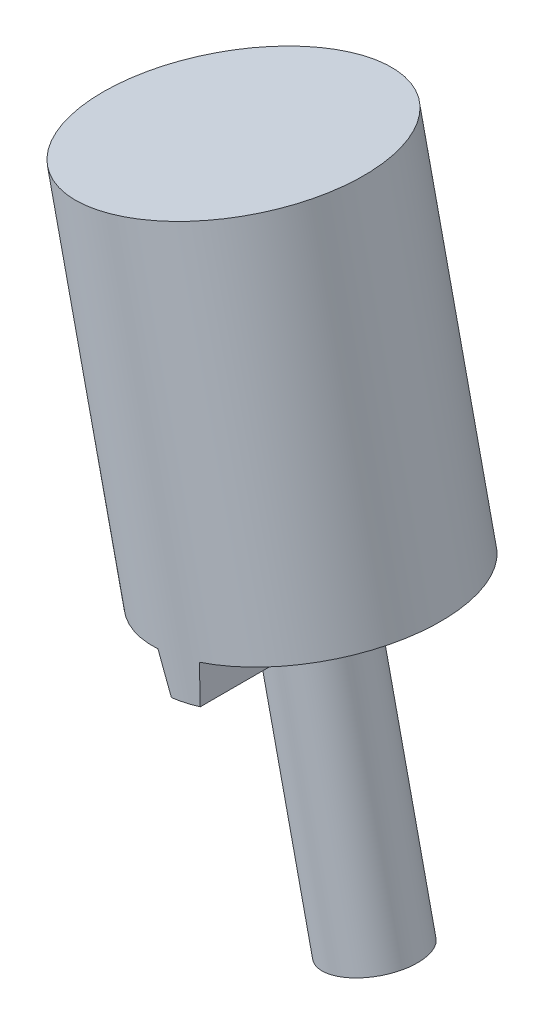
ISO-10303-21;
HEADER;
FILE_DESCRIPTION(('STEP AP214'),'2;1');
FILE_NAME('part.step','',(''),(''),'','','');
FILE_SCHEMA(('AUTOMOTIVE_DESIGN { 1 0 10303 214 1 1 1 1 }'));
ENDSEC;
DATA;
#1=APPLICATION_CONTEXT('core data for automotive mechanical design processes');
#2=APPLICATION_PROTOCOL_DEFINITION('international standard','automotive_design',2000,#1);
#3=PRODUCT_CONTEXT('',#1,'mechanical');
#4=PRODUCT('Part','Part','',(#3));
#5=PRODUCT_RELATED_PRODUCT_CATEGORY('part','',(#4));
#6=PRODUCT_DEFINITION_FORMATION('','',#4);
#7=PRODUCT_DEFINITION_CONTEXT('part definition',#1,'design');
#8=PRODUCT_DEFINITION('design','',#6,#7);
#9=PRODUCT_DEFINITION_SHAPE('','',#8);
#10=(LENGTH_UNIT() NAMED_UNIT(*) SI_UNIT(.MILLI.,.METRE.));
#11=(NAMED_UNIT(*) PLANE_ANGLE_UNIT() SI_UNIT($,.RADIAN.));
#12=(NAMED_UNIT(*) SI_UNIT($,.STERADIAN.) SOLID_ANGLE_UNIT());
#13=UNCERTAINTY_MEASURE_WITH_UNIT(LENGTH_MEASURE(1.E-05),#10,'distance_accuracy_value','');
#14=(GEOMETRIC_REPRESENTATION_CONTEXT(3) GLOBAL_UNCERTAINTY_ASSIGNED_CONTEXT((#13)) GLOBAL_UNIT_ASSIGNED_CONTEXT((#10,
#11,#12)) REPRESENTATION_CONTEXT('',''));
#15=CARTESIAN_POINT('',(0.,0.,0.));
#16=DIRECTION('',(0.,0.,1.));
#17=DIRECTION('',(1.,0.,0.));
#18=AXIS2_PLACEMENT_3D('',#15,#16,#17);
#19=CARTESIAN_POINT('',(-0.694547757658262,0.496439960766251,2.2987));
#20=DIRECTION('',(0.216439613938103,-0.976296007119933,0.));
#21=DIRECTION('',(0.976296007119933,0.216439613938103,0.));
#22=AXIS2_PLACEMENT_3D('',#19,#20,#21);
#23=PLANE('',#22);
#24=DIRECTION('',(0.,0.,1.));
#25=VECTOR('',#24,1.);
#26=CARTESIAN_POINT('',(-1.19050612927519,0.386488636885694,2.2987));
#27=LINE('',#26,#25);
#28=CARTESIAN_POINT('',(-1.19050612927519,0.386488636885694,-2.28462375239338));
#29=VERTEX_POINT('',#28);
#30=CARTESIAN_POINT('',(-1.19050612927519,0.386488636885694,-0.718420489685532));
#31=VERTEX_POINT('',#30);
#32=EDGE_CURVE('E117',#29,#31,#27,.T.);
#33=ORIENTED_EDGE('',*,*,#32,.F.);
#34=CARTESIAN_POINT('',(-0.942526943466727,0.441464298825973,0.));
#35=DIRECTION('',(-0.216439613938103,0.976296007119933,0.));
#36=DIRECTION('',(-0.976296007119933,-0.216439613938103,0.));
#37=AXIS2_PLACEMENT_3D('',#34,#35,#36);
#38=CIRCLE('',#37,2.2987);
#39=CARTESIAN_POINT('',(-0.694547757658263,0.496439960766251,-2.28462375239338));
#40=VERTEX_POINT('',#39);
#41=EDGE_CURVE('E92',#29,#40,#38,.F.);
#42=ORIENTED_EDGE('',*,*,#41,.T.);
#43=DIRECTION('',(0.,0.,1.));
#44=VECTOR('',#43,1.);
#45=CARTESIAN_POINT('',(-0.694547757658263,0.496439960766251,2.2987));
#46=LINE('',#45,#44);
#47=CARTESIAN_POINT('',(-0.694547757658263,0.496439960766251,-0.718420489685532));
#48=VERTEX_POINT('',#47);
#49=EDGE_CURVE('E94',#48,#40,#46,.F.);
#50=ORIENTED_EDGE('',*,*,#49,.F.);
#51=CARTESIAN_POINT('',(-0.942526943466726,0.441464298825972,0.));
#52=DIRECTION('',(-0.216439613938103,0.976296007119933,0.));
#53=DIRECTION('',(-0.976296007119933,-0.216439613938103,0.));
#54=AXIS2_PLACEMENT_3D('',#51,#52,#53);
#55=CIRCLE('',#54,0.762);
#56=EDGE_CURVE('E20',#48,#31,#55,.T.);
#57=ORIENTED_EDGE('',*,*,#56,.T.);
#58=EDGE_LOOP('',(#33,#42,#50,#57));
#59=FACE_BOUND('',#58,.T.);
#60=ADVANCED_FACE('F17',(#59),#23,.T.);
#61=CARTESIAN_POINT('',(0.763484697913529,-3.73324446700129,0.));
#62=DIRECTION('',(-0.216439613938103,0.976296007119933,0.));
#63=DIRECTION('',(-0.976296007119933,-0.216439613938103,0.));
#64=AXIS2_PLACEMENT_3D('',#61,#62,#63);
#65=PLANE('',#64);
#66=CARTESIAN_POINT('',(0.0195471404881398,-3.89817145282212,0.));
#67=DIRECTION('',(-0.216439613938103,0.976296007119933,0.));
#68=DIRECTION('',(-0.976296007119933,-0.216439613938103,0.));
#69=AXIS2_PLACEMENT_3D('',#66,#67,#68);
#70=CIRCLE('',#69,0.762);
#71=CARTESIAN_POINT('',(-0.724390416937249,-4.06309843864296,0.));
#72=VERTEX_POINT('',#71);
#73=EDGE_CURVE('E105',#72,#72,#70,.T.);
#74=ORIENTED_EDGE('',*,*,#73,.F.);
#75=EDGE_LOOP('',(#74));
#76=FACE_BOUND('',#75,.T.);
#77=ADVANCED_FACE('F179',(#76),#65,.F.);
#78=CARTESIAN_POINT('',(-0.694547757658262,0.496439960766251,2.2987));
#79=DIRECTION('',(0.216439613938103,-0.976296007119933,0.));
#80=DIRECTION('',(0.976296007119933,0.216439613938103,0.));
#81=AXIS2_PLACEMENT_3D('',#78,#79,#80);
#82=PLANE('',#81);
#83=DIRECTION('',(0.,0.,1.));
#84=VECTOR('',#83,1.);
#85=CARTESIAN_POINT('',(-0.694547757658263,0.496439960766251,2.2987));
#86=LINE('',#85,#84);
#87=CARTESIAN_POINT('',(-0.694547757658263,0.496439960766251,2.28462375239338));
#88=VERTEX_POINT('',#87);
#89=CARTESIAN_POINT('',(-0.694547757658263,0.496439960766251,0.718420489685532));
#90=VERTEX_POINT('',#89);
#91=EDGE_CURVE('E121',#88,#90,#86,.F.);
#92=ORIENTED_EDGE('',*,*,#91,.F.);
#93=CARTESIAN_POINT('',(-0.942526943466726,0.441464298825972,0.));
#94=DIRECTION('',(-0.216439613938103,0.976296007119933,0.));
#95=DIRECTION('',(-0.976296007119933,-0.216439613938103,0.));
#96=AXIS2_PLACEMENT_3D('',#93,#94,#95);
#97=CIRCLE('',#96,2.2987);
#98=CARTESIAN_POINT('',(-1.19050612927519,0.386488636885694,2.28462375239338));
#99=VERTEX_POINT('',#98);
#100=EDGE_CURVE('E122',#88,#99,#97,.F.);
#101=ORIENTED_EDGE('',*,*,#100,.T.);
#102=DIRECTION('',(0.,0.,1.));
#103=VECTOR('',#102,1.);
#104=CARTESIAN_POINT('',(-1.19050612927519,0.386488636885694,2.2987));
#105=LINE('',#104,#103);
#106=CARTESIAN_POINT('',(-1.19050612927519,0.386488636885694,0.718420489685532));
#107=VERTEX_POINT('',#106);
#108=EDGE_CURVE('E145',#107,#99,#105,.T.);
#109=ORIENTED_EDGE('',*,*,#108,.F.);
#110=CARTESIAN_POINT('',(-0.942526943466727,0.441464298825973,0.));
#111=DIRECTION('',(-0.216439613938103,0.976296007119933,0.));
#112=DIRECTION('',(-0.976296007119933,-0.216439613938103,0.));
#113=AXIS2_PLACEMENT_3D('',#110,#111,#112);
#114=CIRCLE('',#113,0.762);
#115=EDGE_CURVE('E108',#90,#107,#114,.F.);
#116=ORIENTED_EDGE('',*,*,#115,.F.);
#117=EDGE_LOOP('',(#92,#101,#109,#116));
#118=FACE_BOUND('',#117,.T.);
#119=ADVANCED_FACE('F149',(#118),#82,.T.);
#120=CARTESIAN_POINT('',(-0.722673359728584,1.14062215649335,2.2987));
#121=DIRECTION('',(0.999048221581858,0.043619387365336,0.));
#122=DIRECTION('',(-0.043619387365336,0.999048221581858,0.));
#123=AXIS2_PLACEMENT_3D('',#120,#121,#122);
#124=PLANE('',#123);
#125=DIRECTION('',(0.,0.,1.));
#126=VECTOR('',#125,1.);
#127=CARTESIAN_POINT('',(-0.722673359728584,1.14062215649335,2.2987));
#128=LINE('',#127,#126);
#129=CARTESIAN_POINT('',(-0.722673359728584,1.14062215649335,2.26938083665555));
#130=VERTEX_POINT('',#129);
#131=CARTESIAN_POINT('',(-0.722673359728584,1.14062215649335,0.668364939071052));
#132=VERTEX_POINT('',#131);
#133=EDGE_CURVE('E143',#130,#132,#128,.F.);
#134=ORIENTED_EDGE('',*,*,#133,.F.);
#135=CARTESIAN_POINT('',(-0.630744471383377,-0.964895549293167,0.));
#136=DIRECTION('',(0.999048221581858,0.043619387365336,0.));
#137=DIRECTION('',(-0.043619387365336,0.999048221581858,0.));
#138=AXIS2_PLACEMENT_3D('',#135,#136,#137);
#139=ELLIPSE('',#138,13.2376857096023,2.2987);
#140=EDGE_CURVE('E98',#130,#88,#139,.T.);
#141=ORIENTED_EDGE('',*,*,#140,.T.);
#142=ORIENTED_EDGE('',*,*,#91,.T.);
#143=CARTESIAN_POINT('',(-0.630744471383377,-0.964895549293168,0.));
#144=DIRECTION('',(0.999048221581858,0.043619387365336,0.));
#145=DIRECTION('',(-0.043619387365336,0.999048221581858,0.));
#146=AXIS2_PLACEMENT_3D('',#143,#144,#145);
#147=ELLIPSE('',#146,4.38818310815544,0.762);
#148=EDGE_CURVE('E104',#132,#90,#147,.T.);
#149=ORIENTED_EDGE('',*,*,#148,.F.);
#150=EDGE_LOOP('',(#134,#141,#142,#149));
#151=FACE_BOUND('',#150,.T.);
#152=ADVANCED_FACE('F170',(#151),#124,.T.);
#153=CARTESIAN_POINT('',(-0.722673359728584,1.14062215649335,2.2987));
#154=DIRECTION('',(0.999048221581858,0.043619387365336,0.));
#155=DIRECTION('',(-0.043619387365336,0.999048221581858,0.));
#156=AXIS2_PLACEMENT_3D('',#153,#154,#155);
#157=PLANE('',#156);
#158=ORIENTED_EDGE('',*,*,#49,.T.);
#159=CARTESIAN_POINT('',(-0.630744471383377,-0.964895549293167,0.));
#160=DIRECTION('',(0.999048221581858,0.043619387365336,0.));
#161=DIRECTION('',(-0.043619387365336,0.999048221581858,0.));
#162=AXIS2_PLACEMENT_3D('',#159,#160,#161);
#163=ELLIPSE('',#162,13.2376857096023,2.2987);
#164=CARTESIAN_POINT('',(-0.722673359728584,1.14062215649335,-2.26938083665555));
#165=VERTEX_POINT('',#164);
#166=EDGE_CURVE('E97',#40,#165,#163,.T.);
#167=ORIENTED_EDGE('',*,*,#166,.T.);
#168=DIRECTION('',(0.,0.,1.));
#169=VECTOR('',#168,1.);
#170=CARTESIAN_POINT('',(-0.722673359728584,1.14062215649335,2.2987));
#171=LINE('',#170,#169);
#172=CARTESIAN_POINT('',(-0.722673359728584,1.14062215649335,-0.668364939071053));
#173=VERTEX_POINT('',#172);
#174=EDGE_CURVE('E102',#173,#165,#171,.F.);
#175=ORIENTED_EDGE('',*,*,#174,.F.);
#176=CARTESIAN_POINT('',(-0.630744471383377,-0.964895549293168,0.));
#177=DIRECTION('',(0.999048221581858,0.043619387365336,0.));
#178=DIRECTION('',(-0.043619387365336,0.999048221581858,0.));
#179=AXIS2_PLACEMENT_3D('',#176,#177,#178);
#180=ELLIPSE('',#179,4.38818310815544,0.762);
#181=EDGE_CURVE('E85',#48,#173,#180,.T.);
#182=ORIENTED_EDGE('',*,*,#181,.F.);
#183=EDGE_LOOP('',(#158,#167,#175,#182));
#184=FACE_BOUND('',#183,.T.);
#185=ADVANCED_FACE('F100',(#184),#157,.T.);
#186=CARTESIAN_POINT('',(-1.19050612927519,0.386488636885694,2.2987));
#187=DIRECTION('',(-0.923879532511287,-0.38268343236509,0.));
#188=DIRECTION('',(0.38268343236509,-0.923879532511287,0.));
#189=AXIS2_PLACEMENT_3D('',#186,#187,#188);
#190=PLANE('',#189);
#191=DIRECTION('',(0.,0.,1.));
#192=VECTOR('',#191,1.);
#193=CARTESIAN_POINT('',(-1.43725883690626,0.982202370200907,2.2987));
#194=LINE('',#193,#192);
#195=CARTESIAN_POINT('',(-1.43725883690626,0.982202370200907,-2.26938083665555));
#196=VERTEX_POINT('',#195);
#197=CARTESIAN_POINT('',(-1.43725883690626,0.982202370200907,-0.668364939071053));
#198=VERTEX_POINT('',#197);
#199=EDGE_CURVE('E140',#196,#198,#194,.T.);
#200=ORIENTED_EDGE('',*,*,#199,.F.);
#201=CARTESIAN_POINT('',(-0.630744471383378,-0.964895549293165,0.));
#202=DIRECTION('',(-0.923879532511287,-0.38268343236509,0.));
#203=DIRECTION('',(-0.38268343236509,0.923879532511287,0.));
#204=AXIS2_PLACEMENT_3D('',#201,#202,#203);
#205=ELLIPSE('',#204,13.2376857096023,2.2987);
#206=EDGE_CURVE('E111',#196,#29,#205,.T.);
#207=ORIENTED_EDGE('',*,*,#206,.T.);
#208=ORIENTED_EDGE('',*,*,#32,.T.);
#209=CARTESIAN_POINT('',(-0.630744471383378,-0.964895549293166,0.));
#210=DIRECTION('',(-0.923879532511287,-0.38268343236509,0.));
#211=DIRECTION('',(-0.38268343236509,0.923879532511287,0.));
#212=AXIS2_PLACEMENT_3D('',#209,#210,#211);
#213=ELLIPSE('',#212,4.38818310815545,0.762);
#214=EDGE_CURVE('E88',#198,#31,#213,.T.);
#215=ORIENTED_EDGE('',*,*,#214,.F.);
#216=EDGE_LOOP('',(#200,#207,#208,#215));
#217=FACE_BOUND('',#216,.T.);
#218=ADVANCED_FACE('F163',(#217),#190,.T.);
#219=CARTESIAN_POINT('',(0.0195471404881393,-3.89817145282212,0.));
#220=DIRECTION('',(-0.216439613938103,0.976296007119933,0.));
#221=DIRECTION('',(-0.976296007119933,-0.216439613938103,0.));
#222=AXIS2_PLACEMENT_3D('',#219,#220,#221);
#223=CYLINDRICAL_SURFACE('',#222,0.762);
#224=ORIENTED_EDGE('',*,*,#214,.T.);
#225=ORIENTED_EDGE('',*,*,#56,.F.);
#226=ORIENTED_EDGE('',*,*,#181,.T.);
#227=CARTESIAN_POINT('',(-1.07996609831742,1.06141226334713,0.));
#228=DIRECTION('',(-0.216439613938103,0.976296007119933,0.));
#229=DIRECTION('',(-0.976296007119933,-0.216439613938103,0.));
#230=AXIS2_PLACEMENT_3D('',#227,#228,#229);
#231=CIRCLE('',#230,0.762);
#232=EDGE_CURVE('E141',#132,#173,#231,.T.);
#233=ORIENTED_EDGE('',*,*,#232,.F.);
#234=ORIENTED_EDGE('',*,*,#148,.T.);
#235=ORIENTED_EDGE('',*,*,#115,.T.);
#236=CARTESIAN_POINT('',(-0.630744471383378,-0.964895549293166,0.));
#237=DIRECTION('',(-0.923879532511287,-0.38268343236509,0.));
#238=DIRECTION('',(-0.38268343236509,0.923879532511287,0.));
#239=AXIS2_PLACEMENT_3D('',#236,#237,#238);
#240=ELLIPSE('',#239,4.38818310815545,0.762);
#241=CARTESIAN_POINT('',(-1.43725883690626,0.982202370200907,0.668364939071053));
#242=VERTEX_POINT('',#241);
#243=EDGE_CURVE('E146',#242,#107,#240,.F.);
#244=ORIENTED_EDGE('',*,*,#243,.F.);
#245=CARTESIAN_POINT('',(-1.07996609831742,1.06141226334713,0.));
#246=DIRECTION('',(-0.216439613938103,0.976296007119933,0.));
#247=DIRECTION('',(-0.976296007119933,-0.216439613938103,0.));
#248=AXIS2_PLACEMENT_3D('',#245,#246,#247);
#249=CIRCLE('',#248,0.762);
#250=EDGE_CURVE('E137',#198,#242,#249,.T.);
#251=ORIENTED_EDGE('',*,*,#250,.F.);
#252=EDGE_LOOP('',(#224,#225,#226,#233,#234,#235,#244,#251));
#253=FACE_BOUND('',#252,.T.);
#254=ORIENTED_EDGE('',*,*,#73,.T.);
#255=EDGE_LOOP('',(#254));
#256=FACE_BOUND('',#255,.T.);
#257=ADVANCED_FACE('F81',(#253,#256),#223,.T.);
#258=CARTESIAN_POINT('',(-1.19050612927519,0.386488636885694,2.2987));
#259=DIRECTION('',(-0.923879532511287,-0.38268343236509,0.));
#260=DIRECTION('',(0.38268343236509,-0.923879532511287,0.));
#261=AXIS2_PLACEMENT_3D('',#258,#259,#260);
#262=PLANE('',#261);
#263=ORIENTED_EDGE('',*,*,#108,.T.);
#264=CARTESIAN_POINT('',(-0.630744471383378,-0.964895549293165,0.));
#265=DIRECTION('',(-0.923879532511287,-0.38268343236509,0.));
#266=DIRECTION('',(-0.38268343236509,0.923879532511287,0.));
#267=AXIS2_PLACEMENT_3D('',#264,#265,#266);
#268=ELLIPSE('',#267,13.2376857096023,2.2987);
#269=CARTESIAN_POINT('',(-1.43725883690626,0.982202370200907,2.26938083665555));
#270=VERTEX_POINT('',#269);
#271=EDGE_CURVE('E35',#99,#270,#268,.T.);
#272=ORIENTED_EDGE('',*,*,#271,.T.);
#273=DIRECTION('',(0.,0.,1.));
#274=VECTOR('',#273,1.);
#275=CARTESIAN_POINT('',(-1.43725883690626,0.982202370200907,2.2987));
#276=LINE('',#275,#274);
#277=EDGE_CURVE('E136',#242,#270,#276,.T.);
#278=ORIENTED_EDGE('',*,*,#277,.F.);
#279=ORIENTED_EDGE('',*,*,#243,.T.);
#280=EDGE_LOOP('',(#263,#272,#278,#279));
#281=FACE_BOUND('',#280,.T.);
#282=ADVANCED_FACE('F151',(#281),#262,.T.);
#283=CARTESIAN_POINT('',(1.41222471905763,1.61391766584692,2.2987));
#284=DIRECTION('',(0.216439613938103,-0.976296007119933,0.));
#285=DIRECTION('',(0.976296007119933,0.216439613938103,0.));
#286=AXIS2_PLACEMENT_3D('',#283,#284,#285);
#287=PLANE('',#286);
#288=ORIENTED_EDGE('',*,*,#174,.T.);
#289=CARTESIAN_POINT('',(-1.07996609831742,1.06141226334713,0.));
#290=DIRECTION('',(-0.216439613938103,0.976296007119933,0.));
#291=DIRECTION('',(-0.976296007119933,-0.216439613938103,0.));
#292=AXIS2_PLACEMENT_3D('',#289,#290,#291);
#293=CIRCLE('',#292,2.2987);
#294=EDGE_CURVE('E133',#130,#165,#293,.T.);
#295=ORIENTED_EDGE('',*,*,#294,.F.);
#296=ORIENTED_EDGE('',*,*,#133,.T.);
#297=ORIENTED_EDGE('',*,*,#232,.T.);
#298=EDGE_LOOP('',(#288,#295,#296,#297));
#299=FACE_BOUND('',#298,.T.);
#300=ADVANCED_FACE('F168',(#299),#287,.T.);
#301=CARTESIAN_POINT('',(-1.43725883690626,0.982202370200907,2.2987));
#302=DIRECTION('',(0.216439613938103,-0.976296007119933,0.));
#303=DIRECTION('',(0.976296007119933,0.216439613938103,0.));
#304=AXIS2_PLACEMENT_3D('',#301,#302,#303);
#305=PLANE('',#304);
#306=ORIENTED_EDGE('',*,*,#277,.T.);
#307=CARTESIAN_POINT('',(-1.07996609831742,1.06141226334713,0.));
#308=DIRECTION('',(-0.216439613938103,0.976296007119933,0.));
#309=DIRECTION('',(-0.976296007119933,-0.216439613938103,0.));
#310=AXIS2_PLACEMENT_3D('',#307,#308,#309);
#311=CIRCLE('',#310,2.2987);
#312=EDGE_CURVE('E26',#196,#270,#311,.T.);
#313=ORIENTED_EDGE('',*,*,#312,.F.);
#314=ORIENTED_EDGE('',*,*,#199,.T.);
#315=ORIENTED_EDGE('',*,*,#250,.T.);
#316=EDGE_LOOP('',(#306,#313,#314,#315));
#317=FACE_BOUND('',#316,.T.);
#318=ADVANCED_FACE('F156',(#317),#305,.T.);
#319=CARTESIAN_POINT('',(-2.4063307153215,7.04425642022388,0.));
#320=DIRECTION('',(0.216439613938103,-0.976296007119933,0.));
#321=DIRECTION('',(0.976296007119933,0.216439613938103,0.));
#322=AXIS2_PLACEMENT_3D('',#319,#320,#321);
#323=PLANE('',#322);
#324=CARTESIAN_POINT('',(-2.4063307153215,7.04425642022387,0.));
#325=DIRECTION('',(-0.216439613938103,0.976296007119933,0.));
#326=DIRECTION('',(-0.976296007119933,-0.216439613938103,0.));
#327=AXIS2_PLACEMENT_3D('',#324,#325,#326);
#328=CIRCLE('',#327,2.2987);
#329=CARTESIAN_POINT('',(-4.65054234688809,6.54672667966435,0.));
#330=VERTEX_POINT('',#329);
#331=EDGE_CURVE('E11',#330,#330,#328,.F.);
#332=ORIENTED_EDGE('',*,*,#331,.F.);
#333=EDGE_LOOP('',(#332));
#334=FACE_BOUND('',#333,.T.);
#335=ADVANCED_FACE('F182',(#334),#323,.F.);
#336=CARTESIAN_POINT('',(-0.805087788616031,-0.178483665695186,0.));
#337=DIRECTION('',(-0.216439613938103,0.976296007119933,0.));
#338=DIRECTION('',(-0.976296007119933,-0.216439613938103,0.));
#339=AXIS2_PLACEMENT_3D('',#336,#337,#338);
#340=CYLINDRICAL_SURFACE('',#339,2.2987);
#341=ORIENTED_EDGE('',*,*,#331,.T.);
#342=EDGE_LOOP('',(#341));
#343=FACE_BOUND('',#342,.T.);
#344=ORIENTED_EDGE('',*,*,#271,.F.);
#345=ORIENTED_EDGE('',*,*,#100,.F.);
#346=ORIENTED_EDGE('',*,*,#140,.F.);
#347=ORIENTED_EDGE('',*,*,#294,.T.);
#348=ORIENTED_EDGE('',*,*,#166,.F.);
#349=ORIENTED_EDGE('',*,*,#41,.F.);
#350=ORIENTED_EDGE('',*,*,#206,.F.);
#351=ORIENTED_EDGE('',*,*,#312,.T.);
#352=EDGE_LOOP('',(#344,#345,#346,#347,#348,#349,#350,#351));
#353=FACE_BOUND('',#352,.T.);
#354=ADVANCED_FACE('F165',(#343,#353),#340,.T.);
#355=CLOSED_SHELL('',(#60,#77,#119,#152,#185,#218,#257,#282,#300,#318,#335,#354));
#356=MANIFOLD_SOLID_BREP('B1',#355);
#357=ADVANCED_BREP_SHAPE_REPRESENTATION('',(#18,#356),#14);
#358=SHAPE_DEFINITION_REPRESENTATION(#9,#357);
ENDSEC;
END-ISO-10303-21;
